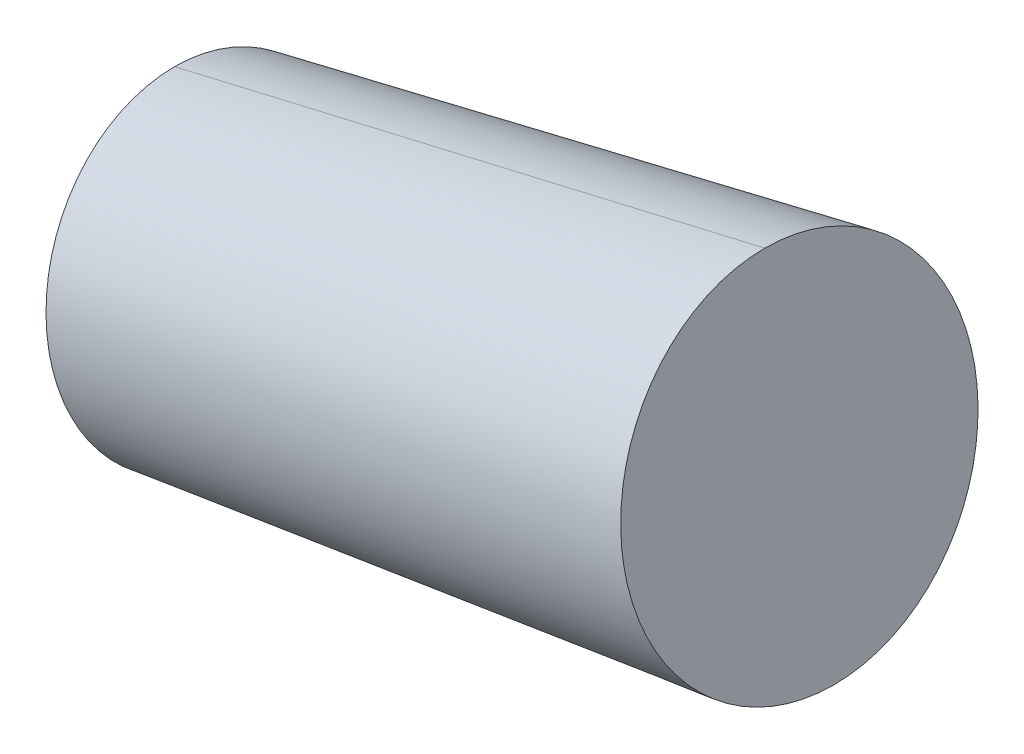
ISO-10303-21;
HEADER;
FILE_DESCRIPTION(('STEP AP214'),'2;1');
FILE_NAME('part.step','',(''),(''),'','','');
FILE_SCHEMA(('AUTOMOTIVE_DESIGN { 1 0 10303 214 1 1 1 1 }'));
ENDSEC;
DATA;
#1=APPLICATION_CONTEXT('core data for automotive mechanical design processes');
#2=APPLICATION_PROTOCOL_DEFINITION('international standard','automotive_design',2000,#1);
#3=PRODUCT_CONTEXT('',#1,'mechanical');
#4=PRODUCT('Part','Part','',(#3));
#5=PRODUCT_RELATED_PRODUCT_CATEGORY('part','',(#4));
#6=PRODUCT_DEFINITION_FORMATION('','',#4);
#7=PRODUCT_DEFINITION_CONTEXT('part definition',#1,'design');
#8=PRODUCT_DEFINITION('design','',#6,#7);
#9=PRODUCT_DEFINITION_SHAPE('','',#8);
#10=(LENGTH_UNIT() NAMED_UNIT(*) SI_UNIT(.MILLI.,.METRE.));
#11=(NAMED_UNIT(*) PLANE_ANGLE_UNIT() SI_UNIT($,.RADIAN.));
#12=(NAMED_UNIT(*) SI_UNIT($,.STERADIAN.) SOLID_ANGLE_UNIT());
#13=UNCERTAINTY_MEASURE_WITH_UNIT(LENGTH_MEASURE(1.E-05),#10,'distance_accuracy_value','');
#14=(GEOMETRIC_REPRESENTATION_CONTEXT(3) GLOBAL_UNCERTAINTY_ASSIGNED_CONTEXT((#13)) GLOBAL_UNIT_ASSIGNED_CONTEXT((#10,
#11,#12)) REPRESENTATION_CONTEXT('',''));
#15=CARTESIAN_POINT('',(0.,0.,0.));
#16=DIRECTION('',(0.,0.,1.));
#17=DIRECTION('',(1.,0.,0.));
#18=AXIS2_PLACEMENT_3D('',#15,#16,#17);
#19=CARTESIAN_POINT('',(13.8247189430497,24.762535530354,0.));
#20=DIRECTION('',(-0.980386574400145,-0.19708415648131,0.));
#21=DIRECTION('',(0.19708415648131,-0.980386574400145,0.));
#22=AXIS2_PLACEMENT_3D('',#19,#20,#21);
#23=PLANE('',#22);
#24=CARTESIAN_POINT('',(13.8247189430494,24.7625355303539,0.));
#25=DIRECTION('',(-0.980386574400145,-0.19708415648131,0.));
#26=DIRECTION('',(0.19708415648131,-0.980386574400145,0.));
#27=AXIS2_PLACEMENT_3D('',#24,#25,#26);
#28=CIRCLE('',#27,3.87657650625547);
#29=CARTESIAN_POINT('',(13.0607071322788,28.5630790917218,0.));
#30=VERTEX_POINT('',#29);
#31=CARTESIAN_POINT('',(14.58873075382,20.961991968986,0.));
#32=VERTEX_POINT('',#31);
#33=EDGE_CURVE('E11',#30,#32,#28,.T.);
#34=ORIENTED_EDGE('',*,*,#33,.F.);
#35=CARTESIAN_POINT('',(13.8247189430494,24.7625355303539,0.));
#36=DIRECTION('',(-0.980386574400145,-0.19708415648131,0.));
#37=DIRECTION('',(0.19708415648131,-0.980386574400145,0.));
#38=AXIS2_PLACEMENT_3D('',#35,#36,#37);
#39=CIRCLE('',#38,3.87657650625547);
#40=EDGE_CURVE('E25',#32,#30,#39,.T.);
#41=ORIENTED_EDGE('',*,*,#40,.F.);
#42=EDGE_LOOP('',(#34,#41));
#43=FACE_BOUND('',#42,.T.);
#44=ADVANCED_FACE('F17',(#43),#23,.F.);
#45=CARTESIAN_POINT('',(13.8247189430494,24.7625355303539,0.));
#46=DIRECTION('',(0.980386574400145,0.19708415648131,0.));
#47=DIRECTION('',(0.,0.,-1.));
#48=AXIS2_PLACEMENT_3D('',#45,#46,#47);
#49=CONICAL_SURFACE('',#48,3.87657650625547,0.0311279472093461);
#50=DIRECTION('',(0.98604547495221,0.166476188466312,0.));
#51=VECTOR('',#50,1.);
#52=CARTESIAN_POINT('',(1.37177542227541,18.73054483737,0.));
#53=LINE('',#52,#51);
#54=CARTESIAN_POINT('',(1.3717754222754,18.73054483737,0.));
#55=VERTEX_POINT('',#54);
#56=EDGE_CURVE('E43',#55,#32,#53,.T.);
#57=ORIENTED_EDGE('',*,*,#56,.T.);
#58=ORIENTED_EDGE('',*,*,#40,.T.);
#59=DIRECTION('',(0.973777805863172,0.227501175399837,0.));
#60=VECTOR('',#59,1.);
#61=CARTESIAN_POINT('',(0.00818765941486177,25.51365292476,0.));
#62=LINE('',#61,#60);
#63=CARTESIAN_POINT('',(0.00818765941486177,25.51365292476,0.));
#64=VERTEX_POINT('',#63);
#65=EDGE_CURVE('E45',#64,#30,#62,.T.);
#66=ORIENTED_EDGE('',*,*,#65,.F.);
#67=CARTESIAN_POINT('',(0.689981540845131,22.122098881065,0.));
#68=DIRECTION('',(-0.980386574400145,-0.19708415648131,0.));
#69=DIRECTION('',(0.19708415648131,-0.980386574400145,0.));
#70=AXIS2_PLACEMENT_3D('',#67,#68,#69);
#71=CIRCLE('',#70,3.45940482280688);
#72=EDGE_CURVE('E40',#55,#64,#71,.T.);
#73=ORIENTED_EDGE('',*,*,#72,.F.);
#74=EDGE_LOOP('',(#57,#58,#66,#73));
#75=FACE_BOUND('',#74,.T.);
#76=ADVANCED_FACE('F42',(#75),#49,.T.);
#77=CARTESIAN_POINT('',(1.37177542227544,18.73054483737,0.));
#78=DIRECTION('',(0.980386574400145,0.19708415648131,0.));
#79=DIRECTION('',(-0.19708415648131,0.980386574400145,0.));
#80=AXIS2_PLACEMENT_3D('',#77,#78,#79);
#81=PLANE('',#80);
#82=ORIENTED_EDGE('',*,*,#72,.T.);
#83=CARTESIAN_POINT('',(0.689981540845131,22.122098881065,0.));
#84=DIRECTION('',(-0.980386574400145,-0.19708415648131,0.));
#85=DIRECTION('',(0.19708415648131,-0.980386574400145,0.));
#86=AXIS2_PLACEMENT_3D('',#83,#84,#85);
#87=CIRCLE('',#86,3.45940482280688);
#88=EDGE_CURVE('E49',#64,#55,#87,.T.);
#89=ORIENTED_EDGE('',*,*,#88,.T.);
#90=EDGE_LOOP('',(#82,#89));
#91=FACE_BOUND('',#90,.T.);
#92=ADVANCED_FACE('F54',(#91),#81,.F.);
#93=CARTESIAN_POINT('',(13.8247189430494,24.7625355303539,0.));
#94=DIRECTION('',(0.980386574400145,0.19708415648131,0.));
#95=DIRECTION('',(0.,0.,1.));
#96=AXIS2_PLACEMENT_3D('',#93,#94,#95);
#97=CONICAL_SURFACE('',#96,3.87657650625547,0.0311279472093461);
#98=ORIENTED_EDGE('',*,*,#56,.F.);
#99=ORIENTED_EDGE('',*,*,#88,.F.);
#100=ORIENTED_EDGE('',*,*,#65,.T.);
#101=ORIENTED_EDGE('',*,*,#33,.T.);
#102=EDGE_LOOP('',(#98,#99,#100,#101));
#103=FACE_BOUND('',#102,.T.);
#104=ADVANCED_FACE('F52',(#103),#97,.T.);
#105=CLOSED_SHELL('',(#44,#76,#92,#104));
#106=MANIFOLD_SOLID_BREP('B1',#105);
#107=ADVANCED_BREP_SHAPE_REPRESENTATION('',(#18,#106),#14);
#108=SHAPE_DEFINITION_REPRESENTATION(#9,#107);
ENDSEC;
END-ISO-10303-21;
